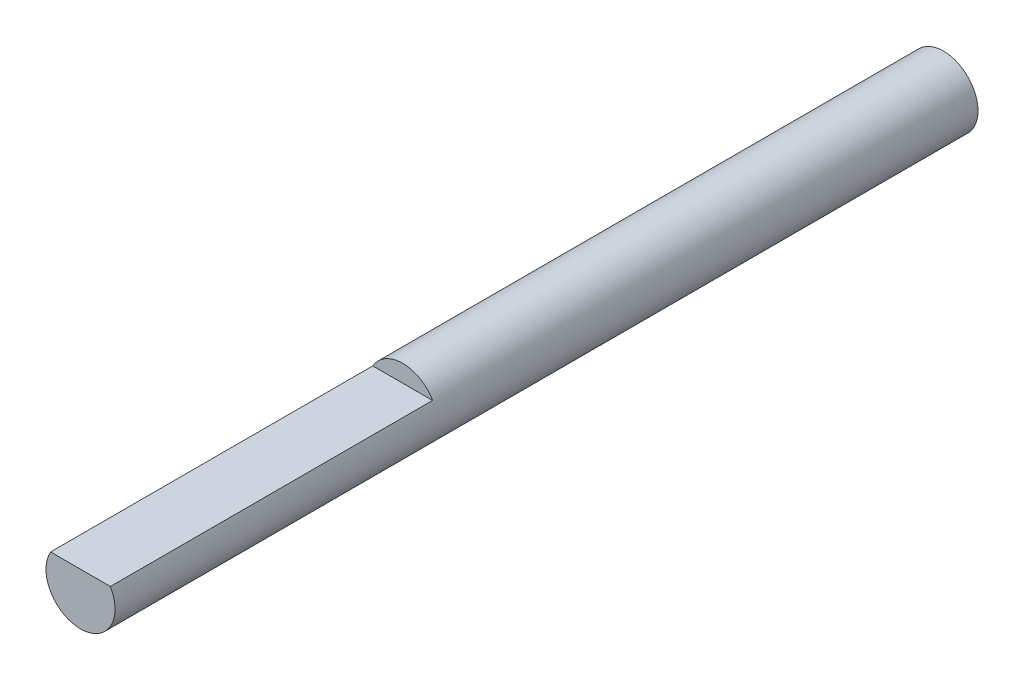
ISO-10303-21;
HEADER;
FILE_DESCRIPTION(('STEP AP214'),'2;1');
FILE_NAME('part.step','',(''),(''),'','','');
FILE_SCHEMA(('AUTOMOTIVE_DESIGN { 1 0 10303 214 1 1 1 1 }'));
ENDSEC;
DATA;
#1=APPLICATION_CONTEXT('core data for automotive mechanical design processes');
#2=APPLICATION_PROTOCOL_DEFINITION('international standard','automotive_design',2000,#1);
#3=PRODUCT_CONTEXT('',#1,'mechanical');
#4=PRODUCT('Part','Part','',(#3));
#5=PRODUCT_RELATED_PRODUCT_CATEGORY('part','',(#4));
#6=PRODUCT_DEFINITION_FORMATION('','',#4);
#7=PRODUCT_DEFINITION_CONTEXT('part definition',#1,'design');
#8=PRODUCT_DEFINITION('design','',#6,#7);
#9=PRODUCT_DEFINITION_SHAPE('','',#8);
#10=(LENGTH_UNIT() NAMED_UNIT(*) SI_UNIT(.MILLI.,.METRE.));
#11=(NAMED_UNIT(*) PLANE_ANGLE_UNIT() SI_UNIT($,.RADIAN.));
#12=(NAMED_UNIT(*) SI_UNIT($,.STERADIAN.) SOLID_ANGLE_UNIT());
#13=UNCERTAINTY_MEASURE_WITH_UNIT(LENGTH_MEASURE(1.E-05),#10,'distance_accuracy_value','');
#14=(GEOMETRIC_REPRESENTATION_CONTEXT(3) GLOBAL_UNCERTAINTY_ASSIGNED_CONTEXT((#13)) GLOBAL_UNIT_ASSIGNED_CONTEXT((#10,
#11,#12)) REPRESENTATION_CONTEXT('',''));
#15=CARTESIAN_POINT('',(0.,0.,0.));
#16=DIRECTION('',(0.,0.,1.));
#17=DIRECTION('',(1.,0.,0.));
#18=AXIS2_PLACEMENT_3D('',#15,#16,#17);
#19=CARTESIAN_POINT('',(0.,0.,150.));
#20=DIRECTION('',(0.,0.,-1.));
#21=DIRECTION('',(-1.,0.,0.));
#22=AXIS2_PLACEMENT_3D('',#19,#20,#21);
#23=CYLINDRICAL_SURFACE('',#22,6.);
#24=CARTESIAN_POINT('',(0.,0.,150.));
#25=DIRECTION('',(0.,0.,1.));
#26=DIRECTION('',(1.,0.,0.));
#27=AXIS2_PLACEMENT_3D('',#24,#25,#26);
#28=CIRCLE('',#27,6.);
#29=CARTESIAN_POINT('',(-5.19615242270653,3.00000000000018,150.));
#30=VERTEX_POINT('',#29);
#31=CARTESIAN_POINT('',(5.19615242270674,3.00000000000018,150.));
#32=VERTEX_POINT('',#31);
#33=EDGE_CURVE('E11',#30,#32,#28,.T.);
#34=ORIENTED_EDGE('',*,*,#33,.F.);
#35=DIRECTION('',(0.,0.,1.));
#36=VECTOR('',#35,1.);
#37=CARTESIAN_POINT('',(-5.19615242270728,3.00000000000018,94.));
#38=LINE('',#37,#36);
#39=CARTESIAN_POINT('',(-5.19615242270728,3.00000000000018,94.));
#40=VERTEX_POINT('',#39);
#41=EDGE_CURVE('E60',#40,#30,#38,.T.);
#42=ORIENTED_EDGE('',*,*,#41,.F.);
#43=CARTESIAN_POINT('',(0.,0.,94.));
#44=DIRECTION('',(0.,0.,1.));
#45=DIRECTION('',(1.00000000000006,0.,0.));
#46=AXIS2_PLACEMENT_3D('',#43,#44,#45);
#47=CIRCLE('',#46,6.);
#48=CARTESIAN_POINT('',(5.19615242270674,3.00000000000018,94.));
#49=VERTEX_POINT('',#48);
#50=EDGE_CURVE('E76',#49,#40,#47,.T.);
#51=ORIENTED_EDGE('',*,*,#50,.F.);
#52=DIRECTION('',(0.,0.,1.));
#53=VECTOR('',#52,1.);
#54=CARTESIAN_POINT('',(5.19615242270674,3.00000000000018,94.));
#55=LINE('',#54,#53);
#56=EDGE_CURVE('E66',#49,#32,#55,.T.);
#57=ORIENTED_EDGE('',*,*,#56,.T.);
#58=EDGE_LOOP('',(#34,#42,#51,#57));
#59=FACE_BOUND('',#58,.T.);
#60=CARTESIAN_POINT('',(0.,0.,0.));
#61=DIRECTION('',(0.,0.,1.));
#62=DIRECTION('',(1.,0.,0.));
#63=AXIS2_PLACEMENT_3D('',#60,#61,#62);
#64=CIRCLE('',#63,6.);
#65=CARTESIAN_POINT('',(6.,0.,0.));
#66=VERTEX_POINT('',#65);
#67=EDGE_CURVE('E48',#66,#66,#64,.T.);
#68=ORIENTED_EDGE('',*,*,#67,.T.);
#69=EDGE_LOOP('',(#68));
#70=FACE_BOUND('',#69,.T.);
#71=ADVANCED_FACE('F45',(#59,#70),#23,.T.);
#72=CARTESIAN_POINT('',(0.,0.,150.));
#73=DIRECTION('',(0.,0.,1.));
#74=DIRECTION('',(1.,0.,0.));
#75=AXIS2_PLACEMENT_3D('',#72,#73,#74);
#76=PLANE('',#75);
#77=DIRECTION('',(1.00000000000006,0.,0.));
#78=VECTOR('',#77,1.);
#79=CARTESIAN_POINT('',(-3.33066907387547E-13,3.00000000000018,150.));
#80=LINE('',#79,#78);
#81=EDGE_CURVE('E71',#30,#32,#80,.T.);
#82=ORIENTED_EDGE('',*,*,#81,.F.);
#83=ORIENTED_EDGE('',*,*,#33,.T.);
#84=EDGE_LOOP('',(#82,#83));
#85=FACE_BOUND('',#84,.T.);
#86=ADVANCED_FACE('F83',(#85),#76,.T.);
#87=CARTESIAN_POINT('',(0.,0.,0.));
#88=DIRECTION('',(0.,0.,1.));
#89=DIRECTION('',(1.,0.,0.));
#90=AXIS2_PLACEMENT_3D('',#87,#88,#89);
#91=PLANE('',#90);
#92=ORIENTED_EDGE('',*,*,#67,.F.);
#93=EDGE_LOOP('',(#92));
#94=FACE_BOUND('',#93,.T.);
#95=ADVANCED_FACE('F85',(#94),#91,.F.);
#96=CARTESIAN_POINT('',(-3.33066907387547E-13,3.00000000000018,94.));
#97=DIRECTION('',(0.,-1.,0.));
#98=DIRECTION('',(1.,0.,0.));
#99=AXIS2_PLACEMENT_3D('',#96,#97,#98);
#100=PLANE('',#99);
#101=ORIENTED_EDGE('',*,*,#81,.T.);
#102=ORIENTED_EDGE('',*,*,#56,.F.);
#103=DIRECTION('',(1.00000000000006,0.,0.));
#104=VECTOR('',#103,1.);
#105=CARTESIAN_POINT('',(-3.33066907387547E-13,3.00000000000018,94.));
#106=LINE('',#105,#104);
#107=EDGE_CURVE('E100',#40,#49,#106,.T.);
#108=ORIENTED_EDGE('',*,*,#107,.F.);
#109=ORIENTED_EDGE('',*,*,#41,.T.);
#110=EDGE_LOOP('',(#101,#102,#108,#109));
#111=FACE_BOUND('',#110,.T.);
#112=ADVANCED_FACE('F72',(#111),#100,.F.);
#113=CARTESIAN_POINT('',(0.,0.,94.));
#114=DIRECTION('',(0.,0.,1.));
#115=DIRECTION('',(1.00000000000006,0.,0.));
#116=AXIS2_PLACEMENT_3D('',#113,#114,#115);
#117=PLANE('',#116);
#118=ORIENTED_EDGE('',*,*,#50,.T.);
#119=ORIENTED_EDGE('',*,*,#107,.T.);
#120=EDGE_LOOP('',(#118,#119));
#121=FACE_BOUND('',#120,.T.);
#122=ADVANCED_FACE('F95',(#121),#117,.T.);
#123=CLOSED_SHELL('',(#71,#86,#95,#112,#122));
#124=MANIFOLD_SOLID_BREP('B2',#123);
#125=ADVANCED_BREP_SHAPE_REPRESENTATION('',(#18,#124),#14);
#126=SHAPE_DEFINITION_REPRESENTATION(#9,#125);
ENDSEC;
END-ISO-10303-21;
